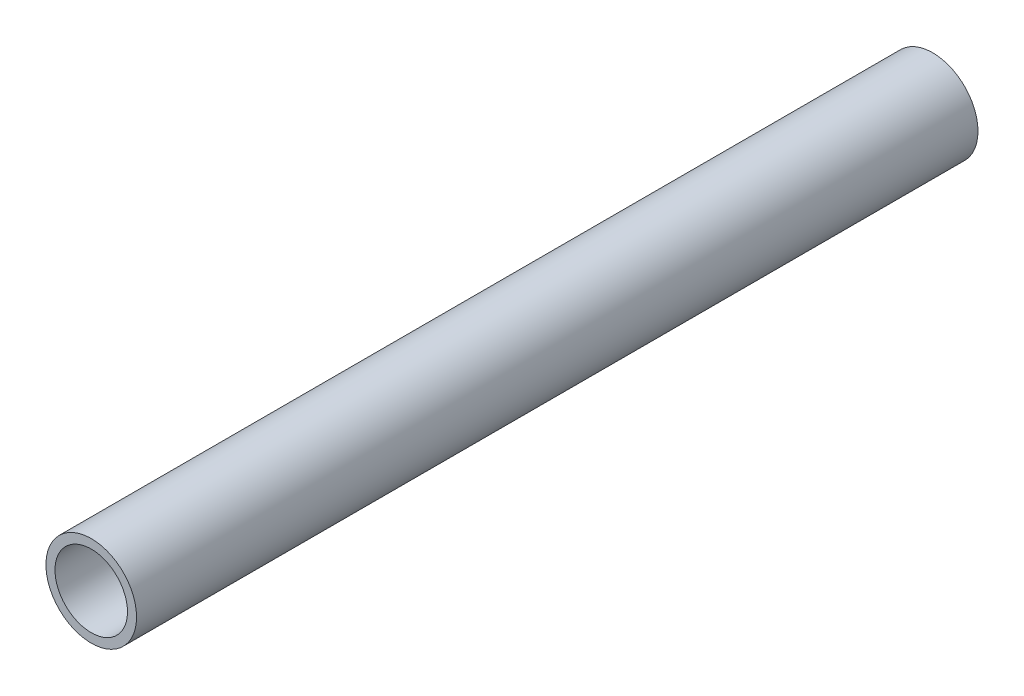
ISO-10303-21;
HEADER;
FILE_DESCRIPTION(('STEP AP214'),'2;1');
FILE_NAME('part.step','',(''),(''),'','','');
FILE_SCHEMA(('AUTOMOTIVE_DESIGN { 1 0 10303 214 1 1 1 1 }'));
ENDSEC;
DATA;
#1=APPLICATION_CONTEXT('core data for automotive mechanical design processes');
#2=APPLICATION_PROTOCOL_DEFINITION('international standard','automotive_design',2000,#1);
#3=PRODUCT_CONTEXT('',#1,'mechanical');
#4=PRODUCT('Part','Part','',(#3));
#5=PRODUCT_RELATED_PRODUCT_CATEGORY('part','',(#4));
#6=PRODUCT_DEFINITION_FORMATION('','',#4);
#7=PRODUCT_DEFINITION_CONTEXT('part definition',#1,'design');
#8=PRODUCT_DEFINITION('design','',#6,#7);
#9=PRODUCT_DEFINITION_SHAPE('','',#8);
#10=(LENGTH_UNIT() NAMED_UNIT(*) SI_UNIT(.MILLI.,.METRE.));
#11=(NAMED_UNIT(*) PLANE_ANGLE_UNIT() SI_UNIT($,.RADIAN.));
#12=(NAMED_UNIT(*) SI_UNIT($,.STERADIAN.) SOLID_ANGLE_UNIT());
#13=UNCERTAINTY_MEASURE_WITH_UNIT(LENGTH_MEASURE(1.E-05),#10,'distance_accuracy_value','');
#14=(GEOMETRIC_REPRESENTATION_CONTEXT(3) GLOBAL_UNCERTAINTY_ASSIGNED_CONTEXT((#13)) GLOBAL_UNIT_ASSIGNED_CONTEXT((#10,
#11,#12)) REPRESENTATION_CONTEXT('',''));
#15=CARTESIAN_POINT('',(0.,0.,0.));
#16=DIRECTION('',(0.,0.,1.));
#17=DIRECTION('',(1.,0.,0.));
#18=AXIS2_PLACEMENT_3D('',#15,#16,#17);
#19=CARTESIAN_POINT('',(0.,0.,23.21));
#20=DIRECTION('',(0.,0.,1.));
#21=DIRECTION('',(1.,0.,0.));
#22=AXIS2_PLACEMENT_3D('',#19,#20,#21);
#23=PLANE('',#22);
#24=CARTESIAN_POINT('',(0.,0.,23.21));
#25=DIRECTION('',(0.,0.,1.));
#26=DIRECTION('',(1.,0.,0.));
#27=AXIS2_PLACEMENT_3D('',#24,#25,#26);
#28=CIRCLE('',#27,1.25);
#29=CARTESIAN_POINT('',(1.25,0.,23.21));
#30=VERTEX_POINT('',#29);
#31=EDGE_CURVE('E10',#30,#30,#28,.T.);
#32=ORIENTED_EDGE('',*,*,#31,.T.);
#33=EDGE_LOOP('',(#32));
#34=FACE_BOUND('',#33,.T.);
#35=CARTESIAN_POINT('',(0.,0.,23.21));
#36=DIRECTION('',(0.,0.,1.));
#37=DIRECTION('',(1.,0.,0.));
#38=AXIS2_PLACEMENT_3D('',#35,#36,#37);
#39=CIRCLE('',#38,1.);
#40=CARTESIAN_POINT('',(1.,0.,23.21));
#41=VERTEX_POINT('',#40);
#42=EDGE_CURVE('E42',#41,#41,#39,.T.);
#43=ORIENTED_EDGE('',*,*,#42,.F.);
#44=EDGE_LOOP('',(#43));
#45=FACE_BOUND('',#44,.T.);
#46=ADVANCED_FACE('F31',(#34,#45),#23,.T.);
#47=CARTESIAN_POINT('',(0.,0.,0.));
#48=DIRECTION('',(0.,0.,1.));
#49=DIRECTION('',(1.,0.,0.));
#50=AXIS2_PLACEMENT_3D('',#47,#48,#49);
#51=PLANE('',#50);
#52=CARTESIAN_POINT('',(0.,0.,0.));
#53=DIRECTION('',(0.,0.,1.));
#54=DIRECTION('',(1.,0.,0.));
#55=AXIS2_PLACEMENT_3D('',#52,#53,#54);
#56=CIRCLE('',#55,1.25);
#57=CARTESIAN_POINT('',(1.25,0.,0.));
#58=VERTEX_POINT('',#57);
#59=EDGE_CURVE('E35',#58,#58,#56,.T.);
#60=ORIENTED_EDGE('',*,*,#59,.F.);
#61=EDGE_LOOP('',(#60));
#62=FACE_BOUND('',#61,.T.);
#63=CARTESIAN_POINT('',(0.,0.,0.));
#64=DIRECTION('',(0.,0.,1.));
#65=DIRECTION('',(1.,0.,0.));
#66=AXIS2_PLACEMENT_3D('',#63,#64,#65);
#67=CIRCLE('',#66,1.);
#68=CARTESIAN_POINT('',(1.,0.,0.));
#69=VERTEX_POINT('',#68);
#70=EDGE_CURVE('E44',#69,#69,#67,.T.);
#71=ORIENTED_EDGE('',*,*,#70,.T.);
#72=EDGE_LOOP('',(#71));
#73=FACE_BOUND('',#72,.T.);
#74=ADVANCED_FACE('F54',(#62,#73),#51,.F.);
#75=CARTESIAN_POINT('',(0.,0.,23.21));
#76=DIRECTION('',(0.,0.,-1.));
#77=DIRECTION('',(-1.,0.,0.));
#78=AXIS2_PLACEMENT_3D('',#75,#76,#77);
#79=CYLINDRICAL_SURFACE('',#78,1.25);
#80=ORIENTED_EDGE('',*,*,#31,.F.);
#81=EDGE_LOOP('',(#80));
#82=FACE_BOUND('',#81,.T.);
#83=ORIENTED_EDGE('',*,*,#59,.T.);
#84=EDGE_LOOP('',(#83));
#85=FACE_BOUND('',#84,.T.);
#86=ADVANCED_FACE('F33',(#82,#85),#79,.T.);
#87=CARTESIAN_POINT('',(0.,0.,23.21));
#88=DIRECTION('',(0.,0.,-1.));
#89=DIRECTION('',(-1.,0.,0.));
#90=AXIS2_PLACEMENT_3D('',#87,#88,#89);
#91=CYLINDRICAL_SURFACE('',#90,1.);
#92=ORIENTED_EDGE('',*,*,#42,.T.);
#93=EDGE_LOOP('',(#92));
#94=FACE_BOUND('',#93,.T.);
#95=ORIENTED_EDGE('',*,*,#70,.F.);
#96=EDGE_LOOP('',(#95));
#97=FACE_BOUND('',#96,.T.);
#98=ADVANCED_FACE('F50',(#94,#97),#91,.F.);
#99=CLOSED_SHELL('',(#46,#74,#86,#98));
#100=MANIFOLD_SOLID_BREP('B2',#99);
#101=ADVANCED_BREP_SHAPE_REPRESENTATION('',(#18,#100),#14);
#102=SHAPE_DEFINITION_REPRESENTATION(#9,#101);
ENDSEC;
END-ISO-10303-21;
